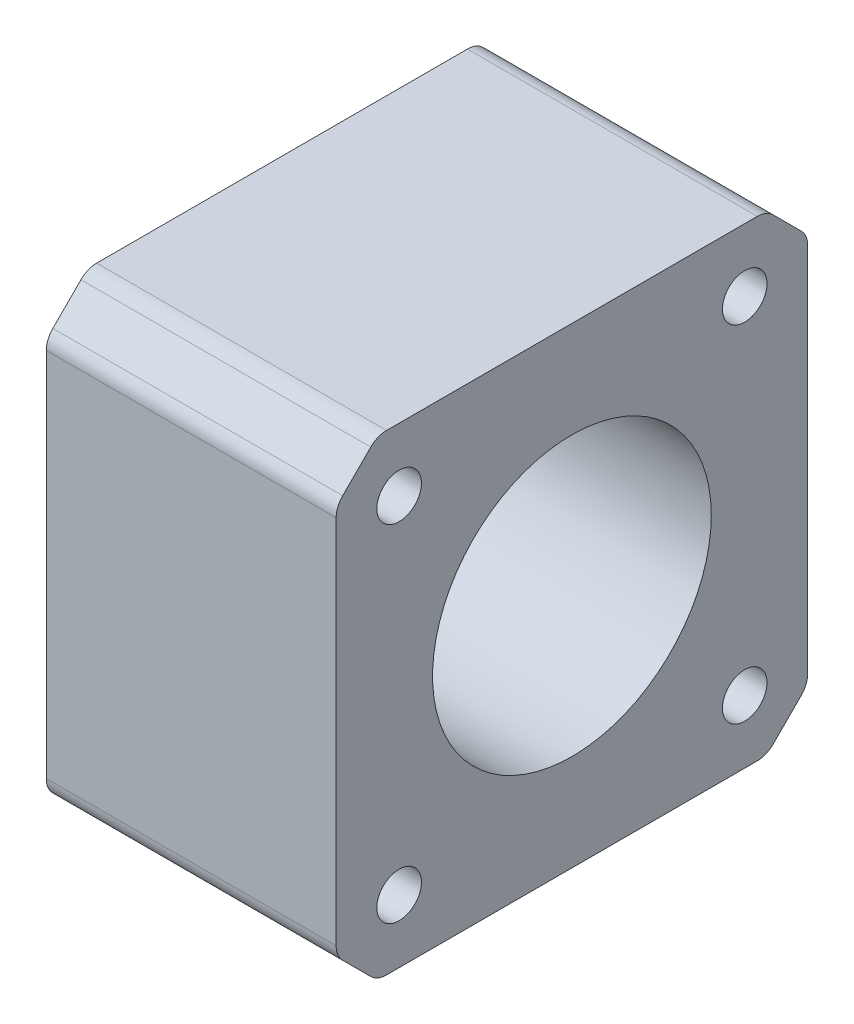
ISO-10303-21;
HEADER;
FILE_DESCRIPTION(('STEP AP214'),'2;1');
FILE_NAME('part.step','',(''),(''),'','','');
FILE_SCHEMA(('AUTOMOTIVE_DESIGN { 1 0 10303 214 1 1 1 1 }'));
ENDSEC;
DATA;
#1=APPLICATION_CONTEXT('core data for automotive mechanical design processes');
#2=APPLICATION_PROTOCOL_DEFINITION('international standard','automotive_design',2000,#1);
#3=PRODUCT_CONTEXT('',#1,'mechanical');
#4=PRODUCT('Part','Part','',(#3));
#5=PRODUCT_RELATED_PRODUCT_CATEGORY('part','',(#4));
#6=PRODUCT_DEFINITION_FORMATION('','',#4);
#7=PRODUCT_DEFINITION_CONTEXT('part definition',#1,'design');
#8=PRODUCT_DEFINITION('design','',#6,#7);
#9=PRODUCT_DEFINITION_SHAPE('','',#8);
#10=(LENGTH_UNIT() NAMED_UNIT(*) SI_UNIT(.MILLI.,.METRE.));
#11=(NAMED_UNIT(*) PLANE_ANGLE_UNIT() SI_UNIT($,.RADIAN.));
#12=(NAMED_UNIT(*) SI_UNIT($,.STERADIAN.) SOLID_ANGLE_UNIT());
#13=UNCERTAINTY_MEASURE_WITH_UNIT(LENGTH_MEASURE(1.E-05),#10,'distance_accuracy_value','');
#14=(GEOMETRIC_REPRESENTATION_CONTEXT(3) GLOBAL_UNCERTAINTY_ASSIGNED_CONTEXT((#13)) GLOBAL_UNIT_ASSIGNED_CONTEXT((#10,
#11,#12)) REPRESENTATION_CONTEXT('',''));
#15=CARTESIAN_POINT('',(0.,0.,0.));
#16=DIRECTION('',(0.,0.,1.));
#17=DIRECTION('',(1.,0.,0.));
#18=AXIS2_PLACEMENT_3D('',#15,#16,#17);
#19=CARTESIAN_POINT('',(26.,0.,0.));
#20=DIRECTION('',(1.,0.,0.));
#21=DIRECTION('',(0.,0.,-1.));
#22=AXIS2_PLACEMENT_3D('',#19,#20,#21);
#23=PLANE('',#22);
#24=CARTESIAN_POINT('',(26.,-15.5,15.5));
#25=DIRECTION('',(-1.,0.,0.));
#26=DIRECTION('',(0.,0.,-1.));
#27=AXIS2_PLACEMENT_3D('',#24,#25,#26);
#28=CIRCLE('',#27,2.);
#29=CARTESIAN_POINT('',(26.,-15.5,13.5));
#30=VERTEX_POINT('',#29);
#31=EDGE_CURVE('E320',#30,#30,#28,.T.);
#32=ORIENTED_EDGE('',*,*,#31,.T.);
#33=EDGE_LOOP('',(#32));
#34=FACE_BOUND('',#33,.T.);
#35=CARTESIAN_POINT('',(26.,15.5,-15.5));
#36=DIRECTION('',(1.,0.,0.));
#37=DIRECTION('',(0.,0.,-1.));
#38=AXIS2_PLACEMENT_3D('',#35,#36,#37);
#39=CIRCLE('',#38,2.);
#40=CARTESIAN_POINT('',(26.,15.5,-17.5));
#41=VERTEX_POINT('',#40);
#42=EDGE_CURVE('E314',#41,#41,#39,.T.);
#43=ORIENTED_EDGE('',*,*,#42,.F.);
#44=EDGE_LOOP('',(#43));
#45=FACE_BOUND('',#44,.T.);
#46=CARTESIAN_POINT('',(26.,15.5,15.5));
#47=DIRECTION('',(1.,0.,0.));
#48=DIRECTION('',(0.,0.,-1.));
#49=AXIS2_PLACEMENT_3D('',#46,#47,#48);
#50=CIRCLE('',#49,2.);
#51=CARTESIAN_POINT('',(26.,15.5,13.5));
#52=VERTEX_POINT('',#51);
#53=EDGE_CURVE('E308',#52,#52,#50,.T.);
#54=ORIENTED_EDGE('',*,*,#53,.F.);
#55=EDGE_LOOP('',(#54));
#56=FACE_BOUND('',#55,.T.);
#57=CARTESIAN_POINT('',(26.,0.,0.));
#58=DIRECTION('',(1.,0.,0.));
#59=DIRECTION('',(0.,0.,-1.));
#60=AXIS2_PLACEMENT_3D('',#57,#58,#59);
#61=CIRCLE('',#60,12.5);
#62=CARTESIAN_POINT('',(26.,0.,-12.5));
#63=VERTEX_POINT('',#62);
#64=EDGE_CURVE('E302',#63,#63,#61,.T.);
#65=ORIENTED_EDGE('',*,*,#64,.F.);
#66=EDGE_LOOP('',(#65));
#67=FACE_BOUND('',#66,.T.);
#68=DIRECTION('',(0.,0.707106781186549,-0.707106781186546));
#69=VECTOR('',#68,1.);
#70=CARTESIAN_POINT('',(26.,-21.15,-17.4580302527855));
#71=LINE('',#70,#69);
#72=CARTESIAN_POINT('',(26.,-20.5642135623731,-18.0438166904124));
#73=VERTEX_POINT('',#72);
#74=CARTESIAN_POINT('',(26.,-18.0438166904124,-20.5642135623731));
#75=VERTEX_POINT('',#74);
#76=EDGE_CURVE('E290',#73,#75,#71,.T.);
#77=ORIENTED_EDGE('',*,*,#76,.T.);
#78=CARTESIAN_POINT('',(26.,-16.6296031280393,-19.15));
#79=DIRECTION('',(1.,0.,0.));
#80=DIRECTION('',(0.,0.,-1.));
#81=AXIS2_PLACEMENT_3D('',#78,#79,#80);
#82=CIRCLE('',#81,2.);
#83=CARTESIAN_POINT('',(26.,-16.6296031280393,-21.15));
#84=VERTEX_POINT('',#83);
#85=EDGE_CURVE('E219',#75,#84,#82,.T.);
#86=ORIENTED_EDGE('',*,*,#85,.T.);
#87=DIRECTION('',(0.,1.,0.));
#88=VECTOR('',#87,1.);
#89=CARTESIAN_POINT('',(26.,17.4580302527855,-21.15));
#90=LINE('',#89,#88);
#91=CARTESIAN_POINT('',(26.,16.6296031280393,-21.15));
#92=VERTEX_POINT('',#91);
#93=EDGE_CURVE('E167',#84,#92,#90,.T.);
#94=ORIENTED_EDGE('',*,*,#93,.T.);
#95=CARTESIAN_POINT('',(26.,16.6296031280393,-19.15));
#96=DIRECTION('',(1.,0.,0.));
#97=DIRECTION('',(0.,0.,-1.));
#98=AXIS2_PLACEMENT_3D('',#95,#96,#97);
#99=CIRCLE('',#98,2.);
#100=CARTESIAN_POINT('',(26.,18.0438166904124,-20.5642135623731));
#101=VERTEX_POINT('',#100);
#102=EDGE_CURVE('E206',#92,#101,#99,.T.);
#103=ORIENTED_EDGE('',*,*,#102,.T.);
#104=DIRECTION('',(0.,0.707106781186543,0.707106781186552));
#105=VECTOR('',#104,1.);
#106=CARTESIAN_POINT('',(26.,21.15,-17.4580302527855));
#107=LINE('',#106,#105);
#108=CARTESIAN_POINT('',(26.,20.5642135623731,-18.0438166904124));
#109=VERTEX_POINT('',#108);
#110=EDGE_CURVE('E251',#101,#109,#107,.T.);
#111=ORIENTED_EDGE('',*,*,#110,.T.);
#112=CARTESIAN_POINT('',(26.,19.15,-16.6296031280393));
#113=DIRECTION('',(1.,0.,0.));
#114=DIRECTION('',(0.,0.,-1.));
#115=AXIS2_PLACEMENT_3D('',#112,#113,#114);
#116=CIRCLE('',#115,2.);
#117=CARTESIAN_POINT('',(26.,21.15,-16.6296031280393));
#118=VERTEX_POINT('',#117);
#119=EDGE_CURVE('E208',#109,#118,#116,.T.);
#120=ORIENTED_EDGE('',*,*,#119,.T.);
#121=DIRECTION('',(0.,0.,1.));
#122=VECTOR('',#121,1.);
#123=CARTESIAN_POINT('',(26.,21.15,17.4580302527855));
#124=LINE('',#123,#122);
#125=CARTESIAN_POINT('',(26.,21.15,16.6296031280393));
#126=VERTEX_POINT('',#125);
#127=EDGE_CURVE('E263',#118,#126,#124,.T.);
#128=ORIENTED_EDGE('',*,*,#127,.T.);
#129=CARTESIAN_POINT('',(26.,19.15,16.6296031280393));
#130=DIRECTION('',(1.,0.,0.));
#131=DIRECTION('',(0.,0.,-1.));
#132=AXIS2_PLACEMENT_3D('',#129,#130,#131);
#133=CIRCLE('',#132,2.);
#134=CARTESIAN_POINT('',(26.,20.5642135623731,18.0438166904124));
#135=VERTEX_POINT('',#134);
#136=EDGE_CURVE('E55',#126,#135,#133,.T.);
#137=ORIENTED_EDGE('',*,*,#136,.T.);
#138=DIRECTION('',(0.,-0.707106781186549,0.707106781186546));
#139=VECTOR('',#138,1.);
#140=CARTESIAN_POINT('',(26.,17.4580302527855,21.15));
#141=LINE('',#140,#139);
#142=CARTESIAN_POINT('',(26.,18.0438166904124,20.5642135623731));
#143=VERTEX_POINT('',#142);
#144=EDGE_CURVE('E189',#135,#143,#141,.T.);
#145=ORIENTED_EDGE('',*,*,#144,.T.);
#146=CARTESIAN_POINT('',(26.,16.6296031280393,19.15));
#147=DIRECTION('',(1.,0.,0.));
#148=DIRECTION('',(0.,0.,-1.));
#149=AXIS2_PLACEMENT_3D('',#146,#147,#148);
#150=CIRCLE('',#149,2.);
#151=CARTESIAN_POINT('',(26.,16.6296031280393,21.15));
#152=VERTEX_POINT('',#151);
#153=EDGE_CURVE('E211',#143,#152,#150,.T.);
#154=ORIENTED_EDGE('',*,*,#153,.T.);
#155=DIRECTION('',(0.,-1.,0.));
#156=VECTOR('',#155,1.);
#157=CARTESIAN_POINT('',(26.,17.4580302527855,21.15));
#158=LINE('',#157,#156);
#159=CARTESIAN_POINT('',(26.,-16.6296031280393,21.15));
#160=VERTEX_POINT('',#159);
#161=EDGE_CURVE('E188',#152,#160,#158,.T.);
#162=ORIENTED_EDGE('',*,*,#161,.T.);
#163=CARTESIAN_POINT('',(26.,-16.6296031280393,19.15));
#164=DIRECTION('',(1.,0.,0.));
#165=DIRECTION('',(0.,0.,-1.));
#166=AXIS2_PLACEMENT_3D('',#163,#164,#165);
#167=CIRCLE('',#166,2.);
#168=CARTESIAN_POINT('',(26.,-18.0438166904124,20.5642135623731));
#169=VERTEX_POINT('',#168);
#170=EDGE_CURVE('E213',#160,#169,#167,.T.);
#171=ORIENTED_EDGE('',*,*,#170,.T.);
#172=DIRECTION('',(0.,-0.707106781186544,-0.707106781186552));
#173=VECTOR('',#172,1.);
#174=CARTESIAN_POINT('',(26.,-21.15,17.4580302527855));
#175=LINE('',#174,#173);
#176=CARTESIAN_POINT('',(26.,-20.5642135623731,18.0438166904124));
#177=VERTEX_POINT('',#176);
#178=EDGE_CURVE('E295',#169,#177,#175,.T.);
#179=ORIENTED_EDGE('',*,*,#178,.T.);
#180=CARTESIAN_POINT('',(26.,-19.15,16.6296031280393));
#181=DIRECTION('',(1.,0.,0.));
#182=DIRECTION('',(0.,0.,-1.));
#183=AXIS2_PLACEMENT_3D('',#180,#181,#182);
#184=CIRCLE('',#183,2.);
#185=CARTESIAN_POINT('',(26.,-21.15,16.6296031280393));
#186=VERTEX_POINT('',#185);
#187=EDGE_CURVE('E215',#177,#186,#184,.T.);
#188=ORIENTED_EDGE('',*,*,#187,.T.);
#189=DIRECTION('',(0.,0.,-1.));
#190=VECTOR('',#189,1.);
#191=CARTESIAN_POINT('',(26.,-21.15,17.4580302527855));
#192=LINE('',#191,#190);
#193=CARTESIAN_POINT('',(26.,-21.15,-16.6296031280393));
#194=VERTEX_POINT('',#193);
#195=EDGE_CURVE('E291',#186,#194,#192,.T.);
#196=ORIENTED_EDGE('',*,*,#195,.T.);
#197=CARTESIAN_POINT('',(26.,-19.15,-16.6296031280393));
#198=DIRECTION('',(1.,0.,0.));
#199=DIRECTION('',(0.,0.,-1.));
#200=AXIS2_PLACEMENT_3D('',#197,#198,#199);
#201=CIRCLE('',#200,2.);
#202=EDGE_CURVE('E217',#194,#73,#201,.T.);
#203=ORIENTED_EDGE('',*,*,#202,.T.);
#204=EDGE_LOOP('',(#77,#86,#94,#103,#111,#120,#128,#137,#145,#154,#162,#171,#179,#188,#196,#203));
#205=FACE_BOUND('',#204,.T.);
#206=CARTESIAN_POINT('',(26.,-15.5,-15.5));
#207=DIRECTION('',(-1.,0.,0.));
#208=DIRECTION('',(0.,0.,-1.));
#209=AXIS2_PLACEMENT_3D('',#206,#207,#208);
#210=CIRCLE('',#209,2.);
#211=CARTESIAN_POINT('',(26.,-15.5,-17.5));
#212=VERTEX_POINT('',#211);
#213=EDGE_CURVE('E326',#212,#212,#210,.T.);
#214=ORIENTED_EDGE('',*,*,#213,.T.);
#215=EDGE_LOOP('',(#214));
#216=FACE_BOUND('',#215,.T.);
#217=ADVANCED_FACE('F33',(#34,#45,#56,#67,#205,#216),#23,.T.);
#218=CARTESIAN_POINT('',(0.,0.,0.));
#219=DIRECTION('',(1.,0.,0.));
#220=DIRECTION('',(0.,0.,-1.));
#221=AXIS2_PLACEMENT_3D('',#218,#219,#220);
#222=PLANE('',#221);
#223=CARTESIAN_POINT('',(0.,-15.5,15.5));
#224=DIRECTION('',(-1.,0.,0.));
#225=DIRECTION('',(0.,0.,-1.));
#226=AXIS2_PLACEMENT_3D('',#223,#224,#225);
#227=CIRCLE('',#226,2.);
#228=CARTESIAN_POINT('',(0.,-15.5,13.5));
#229=VERTEX_POINT('',#228);
#230=EDGE_CURVE('E317',#229,#229,#227,.T.);
#231=ORIENTED_EDGE('',*,*,#230,.F.);
#232=EDGE_LOOP('',(#231));
#233=FACE_BOUND('',#232,.T.);
#234=CARTESIAN_POINT('',(0.,15.5,-15.5));
#235=DIRECTION('',(1.,0.,0.));
#236=DIRECTION('',(0.,0.,-1.));
#237=AXIS2_PLACEMENT_3D('',#234,#235,#236);
#238=CIRCLE('',#237,2.);
#239=CARTESIAN_POINT('',(0.,15.5,-17.5));
#240=VERTEX_POINT('',#239);
#241=EDGE_CURVE('E311',#240,#240,#238,.T.);
#242=ORIENTED_EDGE('',*,*,#241,.T.);
#243=EDGE_LOOP('',(#242));
#244=FACE_BOUND('',#243,.T.);
#245=CARTESIAN_POINT('',(0.,15.5,15.5));
#246=DIRECTION('',(1.,0.,0.));
#247=DIRECTION('',(0.,0.,-1.));
#248=AXIS2_PLACEMENT_3D('',#245,#246,#247);
#249=CIRCLE('',#248,2.);
#250=CARTESIAN_POINT('',(0.,15.5,13.5));
#251=VERTEX_POINT('',#250);
#252=EDGE_CURVE('E305',#251,#251,#249,.T.);
#253=ORIENTED_EDGE('',*,*,#252,.T.);
#254=EDGE_LOOP('',(#253));
#255=FACE_BOUND('',#254,.T.);
#256=CARTESIAN_POINT('',(0.,0.,0.));
#257=DIRECTION('',(1.,0.,0.));
#258=DIRECTION('',(0.,0.,-1.));
#259=AXIS2_PLACEMENT_3D('',#256,#257,#258);
#260=CIRCLE('',#259,12.5);
#261=CARTESIAN_POINT('',(0.,0.,-12.5));
#262=VERTEX_POINT('',#261);
#263=EDGE_CURVE('E273',#262,#262,#260,.T.);
#264=ORIENTED_EDGE('',*,*,#263,.T.);
#265=EDGE_LOOP('',(#264));
#266=FACE_BOUND('',#265,.T.);
#267=DIRECTION('',(0.,1.,0.));
#268=VECTOR('',#267,1.);
#269=CARTESIAN_POINT('',(0.,17.4580302527855,-21.15));
#270=LINE('',#269,#268);
#271=CARTESIAN_POINT('',(0.,-16.6296031280393,-21.15));
#272=VERTEX_POINT('',#271);
#273=CARTESIAN_POINT('',(0.,16.6296031280393,-21.15));
#274=VERTEX_POINT('',#273);
#275=EDGE_CURVE('E164',#272,#274,#270,.T.);
#276=ORIENTED_EDGE('',*,*,#275,.F.);
#277=CARTESIAN_POINT('',(0.,-16.6296031280393,-19.15));
#278=DIRECTION('',(1.,0.,0.));
#279=DIRECTION('',(0.,0.,-1.));
#280=AXIS2_PLACEMENT_3D('',#277,#278,#279);
#281=CIRCLE('',#280,2.);
#282=CARTESIAN_POINT('',(0.,-18.0438166904124,-20.5642135623731));
#283=VERTEX_POINT('',#282);
#284=EDGE_CURVE('E147',#272,#283,#281,.F.);
#285=ORIENTED_EDGE('',*,*,#284,.T.);
#286=DIRECTION('',(0.,0.707106781186549,-0.707106781186546));
#287=VECTOR('',#286,1.);
#288=CARTESIAN_POINT('',(0.,-21.15,-17.4580302527855));
#289=LINE('',#288,#287);
#290=CARTESIAN_POINT('',(0.,-20.5642135623731,-18.0438166904124));
#291=VERTEX_POINT('',#290);
#292=EDGE_CURVE('E175',#291,#283,#289,.T.);
#293=ORIENTED_EDGE('',*,*,#292,.F.);
#294=CARTESIAN_POINT('',(0.,-19.15,-16.6296031280393));
#295=DIRECTION('',(1.,0.,0.));
#296=DIRECTION('',(0.,0.,-1.));
#297=AXIS2_PLACEMENT_3D('',#294,#295,#296);
#298=CIRCLE('',#297,2.);
#299=CARTESIAN_POINT('',(0.,-21.15,-16.6296031280393));
#300=VERTEX_POINT('',#299);
#301=EDGE_CURVE('E158',#291,#300,#298,.F.);
#302=ORIENTED_EDGE('',*,*,#301,.T.);
#303=DIRECTION('',(0.,0.,-1.));
#304=VECTOR('',#303,1.);
#305=CARTESIAN_POINT('',(0.,-21.15,17.4580302527855));
#306=LINE('',#305,#304);
#307=CARTESIAN_POINT('',(0.,-21.15,16.6296031280393));
#308=VERTEX_POINT('',#307);
#309=EDGE_CURVE('E180',#308,#300,#306,.T.);
#310=ORIENTED_EDGE('',*,*,#309,.F.);
#311=CARTESIAN_POINT('',(0.,-19.15,16.6296031280393));
#312=DIRECTION('',(1.,0.,0.));
#313=DIRECTION('',(0.,0.,-1.));
#314=AXIS2_PLACEMENT_3D('',#311,#312,#313);
#315=CIRCLE('',#314,2.);
#316=CARTESIAN_POINT('',(0.,-20.5642135623731,18.0438166904124));
#317=VERTEX_POINT('',#316);
#318=EDGE_CURVE('E200',#308,#317,#315,.F.);
#319=ORIENTED_EDGE('',*,*,#318,.T.);
#320=DIRECTION('',(0.,-0.707106781186544,-0.707106781186552));
#321=VECTOR('',#320,1.);
#322=CARTESIAN_POINT('',(0.,-21.15,17.4580302527855));
#323=LINE('',#322,#321);
#324=CARTESIAN_POINT('',(0.,-18.0438166904124,20.5642135623731));
#325=VERTEX_POINT('',#324);
#326=EDGE_CURVE('E272',#325,#317,#323,.T.);
#327=ORIENTED_EDGE('',*,*,#326,.F.);
#328=CARTESIAN_POINT('',(0.,-16.6296031280393,19.15));
#329=DIRECTION('',(1.,0.,0.));
#330=DIRECTION('',(0.,0.,-1.));
#331=AXIS2_PLACEMENT_3D('',#328,#329,#330);
#332=CIRCLE('',#331,2.);
#333=CARTESIAN_POINT('',(0.,-16.6296031280393,21.15));
#334=VERTEX_POINT('',#333);
#335=EDGE_CURVE('E198',#325,#334,#332,.F.);
#336=ORIENTED_EDGE('',*,*,#335,.T.);
#337=DIRECTION('',(0.,-1.,0.));
#338=VECTOR('',#337,1.);
#339=CARTESIAN_POINT('',(0.,17.4580302527855,21.15));
#340=LINE('',#339,#338);
#341=CARTESIAN_POINT('',(0.,16.6296031280393,21.15));
#342=VERTEX_POINT('',#341);
#343=EDGE_CURVE('E269',#342,#334,#340,.T.);
#344=ORIENTED_EDGE('',*,*,#343,.F.);
#345=CARTESIAN_POINT('',(0.,16.6296031280393,19.15));
#346=DIRECTION('',(1.,0.,0.));
#347=DIRECTION('',(0.,0.,-1.));
#348=AXIS2_PLACEMENT_3D('',#345,#346,#347);
#349=CIRCLE('',#348,2.);
#350=CARTESIAN_POINT('',(0.,18.0438166904124,20.5642135623731));
#351=VERTEX_POINT('',#350);
#352=EDGE_CURVE('E196',#342,#351,#349,.F.);
#353=ORIENTED_EDGE('',*,*,#352,.T.);
#354=DIRECTION('',(0.,-0.707106781186549,0.707106781186546));
#355=VECTOR('',#354,1.);
#356=CARTESIAN_POINT('',(0.,17.4580302527855,21.15));
#357=LINE('',#356,#355);
#358=CARTESIAN_POINT('',(0.,20.5642135623731,18.0438166904124));
#359=VERTEX_POINT('',#358);
#360=EDGE_CURVE('E186',#359,#351,#357,.T.);
#361=ORIENTED_EDGE('',*,*,#360,.F.);
#362=CARTESIAN_POINT('',(0.,19.15,16.6296031280393));
#363=DIRECTION('',(1.,0.,0.));
#364=DIRECTION('',(0.,0.,-1.));
#365=AXIS2_PLACEMENT_3D('',#362,#363,#364);
#366=CIRCLE('',#365,2.);
#367=CARTESIAN_POINT('',(0.,21.15,16.6296031280393));
#368=VERTEX_POINT('',#367);
#369=EDGE_CURVE('E194',#359,#368,#366,.F.);
#370=ORIENTED_EDGE('',*,*,#369,.T.);
#371=DIRECTION('',(0.,0.,1.));
#372=VECTOR('',#371,1.);
#373=CARTESIAN_POINT('',(0.,21.15,17.4580302527855));
#374=LINE('',#373,#372);
#375=CARTESIAN_POINT('',(0.,21.15,-16.6296031280393));
#376=VERTEX_POINT('',#375);
#377=EDGE_CURVE('E178',#376,#368,#374,.T.);
#378=ORIENTED_EDGE('',*,*,#377,.F.);
#379=CARTESIAN_POINT('',(0.,19.15,-16.6296031280393));
#380=DIRECTION('',(1.,0.,0.));
#381=DIRECTION('',(0.,0.,-1.));
#382=AXIS2_PLACEMENT_3D('',#379,#380,#381);
#383=CIRCLE('',#382,2.);
#384=CARTESIAN_POINT('',(0.,20.5642135623731,-18.0438166904124));
#385=VERTEX_POINT('',#384);
#386=EDGE_CURVE('E192',#376,#385,#383,.F.);
#387=ORIENTED_EDGE('',*,*,#386,.T.);
#388=DIRECTION('',(0.,0.707106781186543,0.707106781186552));
#389=VECTOR('',#388,1.);
#390=CARTESIAN_POINT('',(0.,21.15,-17.4580302527855));
#391=LINE('',#390,#389);
#392=CARTESIAN_POINT('',(0.,18.0438166904124,-20.5642135623731));
#393=VERTEX_POINT('',#392);
#394=EDGE_CURVE('E174',#393,#385,#391,.T.);
#395=ORIENTED_EDGE('',*,*,#394,.F.);
#396=CARTESIAN_POINT('',(0.,16.6296031280393,-19.15));
#397=DIRECTION('',(1.,0.,0.));
#398=DIRECTION('',(0.,0.,-1.));
#399=AXIS2_PLACEMENT_3D('',#396,#397,#398);
#400=CIRCLE('',#399,2.);
#401=EDGE_CURVE('E168',#393,#274,#400,.F.);
#402=ORIENTED_EDGE('',*,*,#401,.T.);
#403=EDGE_LOOP('',(#276,#285,#293,#302,#310,#319,#327,#336,#344,#353,#361,#370,#378,#387,#395,#402));
#404=FACE_BOUND('',#403,.T.);
#405=CARTESIAN_POINT('',(0.,-15.5,-15.5));
#406=DIRECTION('',(-1.,0.,0.));
#407=DIRECTION('',(0.,0.,-1.));
#408=AXIS2_PLACEMENT_3D('',#405,#406,#407);
#409=CIRCLE('',#408,2.);
#410=CARTESIAN_POINT('',(0.,-15.5,-17.5));
#411=VERTEX_POINT('',#410);
#412=EDGE_CURVE('E323',#411,#411,#409,.T.);
#413=ORIENTED_EDGE('',*,*,#412,.F.);
#414=EDGE_LOOP('',(#413));
#415=FACE_BOUND('',#414,.T.);
#416=ADVANCED_FACE('F171',(#233,#244,#255,#266,#404,#415),#222,.F.);
#417=CARTESIAN_POINT('',(26.,17.4580302527855,21.15));
#418=DIRECTION('',(0.,0.,-1.));
#419=DIRECTION('',(0.,1.,0.));
#420=AXIS2_PLACEMENT_3D('',#417,#418,#419);
#421=PLANE('',#420);
#422=ORIENTED_EDGE('',*,*,#343,.T.);
#423=DIRECTION('',(-1.,0.,0.));
#424=VECTOR('',#423,1.);
#425=CARTESIAN_POINT('',(26.,-16.6296031280393,21.15));
#426=LINE('',#425,#424);
#427=EDGE_CURVE('E234',#334,#160,#426,.F.);
#428=ORIENTED_EDGE('',*,*,#427,.T.);
#429=ORIENTED_EDGE('',*,*,#161,.F.);
#430=DIRECTION('',(-1.,0.,0.));
#431=VECTOR('',#430,1.);
#432=CARTESIAN_POINT('',(26.,16.6296031280393,21.15));
#433=LINE('',#432,#431);
#434=EDGE_CURVE('E231',#152,#342,#433,.T.);
#435=ORIENTED_EDGE('',*,*,#434,.T.);
#436=EDGE_LOOP('',(#422,#428,#429,#435));
#437=FACE_BOUND('',#436,.T.);
#438=ADVANCED_FACE('F335',(#437),#421,.F.);
#439=CARTESIAN_POINT('',(26.,-21.15,17.4580302527855));
#440=DIRECTION('',(0.,0.707106781186552,-0.707106781186544));
#441=DIRECTION('',(0.,0.707106781186544,0.707106781186552));
#442=AXIS2_PLACEMENT_3D('',#439,#440,#441);
#443=PLANE('',#442);
#444=ORIENTED_EDGE('',*,*,#326,.T.);
#445=DIRECTION('',(-1.,0.,0.));
#446=VECTOR('',#445,1.);
#447=CARTESIAN_POINT('',(26.,-20.5642135623731,18.0438166904124));
#448=LINE('',#447,#446);
#449=EDGE_CURVE('E229',#317,#177,#448,.F.);
#450=ORIENTED_EDGE('',*,*,#449,.T.);
#451=ORIENTED_EDGE('',*,*,#178,.F.);
#452=DIRECTION('',(-1.,0.,0.));
#453=VECTOR('',#452,1.);
#454=CARTESIAN_POINT('',(26.,-18.0438166904124,20.5642135623731));
#455=LINE('',#454,#453);
#456=EDGE_CURVE('E226',#169,#325,#455,.T.);
#457=ORIENTED_EDGE('',*,*,#456,.T.);
#458=EDGE_LOOP('',(#444,#450,#451,#457));
#459=FACE_BOUND('',#458,.T.);
#460=ADVANCED_FACE('F342',(#459),#443,.F.);
#461=CARTESIAN_POINT('',(26.,-21.15,17.4580302527855));
#462=DIRECTION('',(0.,1.,0.));
#463=DIRECTION('',(0.,0.,1.));
#464=AXIS2_PLACEMENT_3D('',#461,#462,#463);
#465=PLANE('',#464);
#466=ORIENTED_EDGE('',*,*,#309,.T.);
#467=DIRECTION('',(-1.,0.,0.));
#468=VECTOR('',#467,1.);
#469=CARTESIAN_POINT('',(26.,-21.15,-16.6296031280393));
#470=LINE('',#469,#468);
#471=EDGE_CURVE('E224',#300,#194,#470,.F.);
#472=ORIENTED_EDGE('',*,*,#471,.T.);
#473=ORIENTED_EDGE('',*,*,#195,.F.);
#474=DIRECTION('',(-1.,0.,0.));
#475=VECTOR('',#474,1.);
#476=CARTESIAN_POINT('',(26.,-21.15,16.6296031280393));
#477=LINE('',#476,#475);
#478=EDGE_CURVE('E221',#186,#308,#477,.T.);
#479=ORIENTED_EDGE('',*,*,#478,.T.);
#480=EDGE_LOOP('',(#466,#472,#473,#479));
#481=FACE_BOUND('',#480,.T.);
#482=ADVANCED_FACE('F279',(#481),#465,.F.);
#483=CARTESIAN_POINT('',(26.,-21.15,-17.4580302527855));
#484=DIRECTION('',(0.,0.707106781186546,0.707106781186549));
#485=DIRECTION('',(0.,-0.707106781186549,0.707106781186546));
#486=AXIS2_PLACEMENT_3D('',#483,#484,#485);
#487=PLANE('',#486);
#488=ORIENTED_EDGE('',*,*,#292,.T.);
#489=DIRECTION('',(-1.,0.,0.));
#490=VECTOR('',#489,1.);
#491=CARTESIAN_POINT('',(26.,-18.0438166904124,-20.5642135623731));
#492=LINE('',#491,#490);
#493=EDGE_CURVE('E152',#283,#75,#492,.F.);
#494=ORIENTED_EDGE('',*,*,#493,.T.);
#495=ORIENTED_EDGE('',*,*,#76,.F.);
#496=DIRECTION('',(-1.,0.,0.));
#497=VECTOR('',#496,1.);
#498=CARTESIAN_POINT('',(26.,-20.5642135623731,-18.0438166904124));
#499=LINE('',#498,#497);
#500=EDGE_CURVE('E157',#73,#291,#499,.T.);
#501=ORIENTED_EDGE('',*,*,#500,.T.);
#502=EDGE_LOOP('',(#488,#494,#495,#501));
#503=FACE_BOUND('',#502,.T.);
#504=ADVANCED_FACE('F293',(#503),#487,.F.);
#505=CARTESIAN_POINT('',(26.,17.4580302527855,-21.15));
#506=DIRECTION('',(0.,0.,1.));
#507=DIRECTION('',(0.,-1.,0.));
#508=AXIS2_PLACEMENT_3D('',#505,#506,#507);
#509=PLANE('',#508);
#510=ORIENTED_EDGE('',*,*,#93,.F.);
#511=DIRECTION('',(-1.,0.,0.));
#512=VECTOR('',#511,1.);
#513=CARTESIAN_POINT('',(26.,-16.6296031280393,-21.15));
#514=LINE('',#513,#512);
#515=EDGE_CURVE('E151',#84,#272,#514,.T.);
#516=ORIENTED_EDGE('',*,*,#515,.T.);
#517=ORIENTED_EDGE('',*,*,#275,.T.);
#518=DIRECTION('',(-1.,0.,0.));
#519=VECTOR('',#518,1.);
#520=CARTESIAN_POINT('',(26.,16.6296031280393,-21.15));
#521=LINE('',#520,#519);
#522=EDGE_CURVE('E169',#274,#92,#521,.F.);
#523=ORIENTED_EDGE('',*,*,#522,.T.);
#524=EDGE_LOOP('',(#510,#516,#517,#523));
#525=FACE_BOUND('',#524,.T.);
#526=ADVANCED_FACE('F163',(#525),#509,.F.);
#527=CARTESIAN_POINT('',(26.,21.15,-17.4580302527855));
#528=DIRECTION('',(0.,-0.707106781186552,0.707106781186543));
#529=DIRECTION('',(0.,-0.707106781186543,-0.707106781186552));
#530=AXIS2_PLACEMENT_3D('',#527,#528,#529);
#531=PLANE('',#530);
#532=ORIENTED_EDGE('',*,*,#394,.T.);
#533=DIRECTION('',(-1.,0.,0.));
#534=VECTOR('',#533,1.);
#535=CARTESIAN_POINT('',(26.,20.5642135623731,-18.0438166904124));
#536=LINE('',#535,#534);
#537=EDGE_CURVE('E11',#385,#109,#536,.F.);
#538=ORIENTED_EDGE('',*,*,#537,.T.);
#539=ORIENTED_EDGE('',*,*,#110,.F.);
#540=DIRECTION('',(-1.,0.,0.));
#541=VECTOR('',#540,1.);
#542=CARTESIAN_POINT('',(26.,18.0438166904124,-20.5642135623731));
#543=LINE('',#542,#541);
#544=EDGE_CURVE('E41',#101,#393,#543,.T.);
#545=ORIENTED_EDGE('',*,*,#544,.T.);
#546=EDGE_LOOP('',(#532,#538,#539,#545));
#547=FACE_BOUND('',#546,.T.);
#548=ADVANCED_FACE('F248',(#547),#531,.F.);
#549=CARTESIAN_POINT('',(26.,21.15,17.4580302527855));
#550=DIRECTION('',(0.,-1.,0.));
#551=DIRECTION('',(0.,0.,-1.));
#552=AXIS2_PLACEMENT_3D('',#549,#550,#551);
#553=PLANE('',#552);
#554=ORIENTED_EDGE('',*,*,#377,.T.);
#555=DIRECTION('',(-1.,0.,0.));
#556=VECTOR('',#555,1.);
#557=CARTESIAN_POINT('',(26.,21.15,16.6296031280393));
#558=LINE('',#557,#556);
#559=EDGE_CURVE('E243',#368,#126,#558,.F.);
#560=ORIENTED_EDGE('',*,*,#559,.T.);
#561=ORIENTED_EDGE('',*,*,#127,.F.);
#562=DIRECTION('',(-1.,0.,0.));
#563=VECTOR('',#562,1.);
#564=CARTESIAN_POINT('',(26.,21.15,-16.6296031280393));
#565=LINE('',#564,#563);
#566=EDGE_CURVE('E240',#118,#376,#565,.T.);
#567=ORIENTED_EDGE('',*,*,#566,.T.);
#568=EDGE_LOOP('',(#554,#560,#561,#567));
#569=FACE_BOUND('',#568,.T.);
#570=ADVANCED_FACE('F261',(#569),#553,.F.);
#571=CARTESIAN_POINT('',(26.,17.4580302527855,21.15));
#572=DIRECTION('',(0.,-0.707106781186546,-0.707106781186549));
#573=DIRECTION('',(0.,0.707106781186549,-0.707106781186546));
#574=AXIS2_PLACEMENT_3D('',#571,#572,#573);
#575=PLANE('',#574);
#576=ORIENTED_EDGE('',*,*,#360,.T.);
#577=DIRECTION('',(-1.,0.,0.));
#578=VECTOR('',#577,1.);
#579=CARTESIAN_POINT('',(26.,18.0438166904124,20.5642135623731));
#580=LINE('',#579,#578);
#581=EDGE_CURVE('E48',#351,#143,#580,.F.);
#582=ORIENTED_EDGE('',*,*,#581,.T.);
#583=ORIENTED_EDGE('',*,*,#144,.F.);
#584=DIRECTION('',(-1.,0.,0.));
#585=VECTOR('',#584,1.);
#586=CARTESIAN_POINT('',(26.,20.5642135623731,18.0438166904124));
#587=LINE('',#586,#585);
#588=EDGE_CURVE('E236',#135,#359,#587,.T.);
#589=ORIENTED_EDGE('',*,*,#588,.T.);
#590=EDGE_LOOP('',(#576,#582,#583,#589));
#591=FACE_BOUND('',#590,.T.);
#592=ADVANCED_FACE('F351',(#591),#575,.F.);
#593=CARTESIAN_POINT('',(26.,-16.6296031280393,-19.15));
#594=DIRECTION('',(-1.,0.,0.));
#595=DIRECTION('',(0.,0.,1.));
#596=AXIS2_PLACEMENT_3D('',#593,#594,#595);
#597=CYLINDRICAL_SURFACE('',#596,2.);
#598=ORIENTED_EDGE('',*,*,#85,.F.);
#599=ORIENTED_EDGE('',*,*,#493,.F.);
#600=ORIENTED_EDGE('',*,*,#284,.F.);
#601=ORIENTED_EDGE('',*,*,#515,.F.);
#602=EDGE_LOOP('',(#598,#599,#600,#601));
#603=FACE_BOUND('',#602,.T.);
#604=ADVANCED_FACE('F150',(#603),#597,.T.);
#605=CARTESIAN_POINT('',(26.,-19.15,-16.6296031280393));
#606=DIRECTION('',(-1.,0.,0.));
#607=DIRECTION('',(0.,0.,1.));
#608=AXIS2_PLACEMENT_3D('',#605,#606,#607);
#609=CYLINDRICAL_SURFACE('',#608,2.);
#610=ORIENTED_EDGE('',*,*,#202,.F.);
#611=ORIENTED_EDGE('',*,*,#471,.F.);
#612=ORIENTED_EDGE('',*,*,#301,.F.);
#613=ORIENTED_EDGE('',*,*,#500,.F.);
#614=EDGE_LOOP('',(#610,#611,#612,#613));
#615=FACE_BOUND('',#614,.T.);
#616=ADVANCED_FACE('F285',(#615),#609,.T.);
#617=CARTESIAN_POINT('',(26.,-19.15,16.6296031280393));
#618=DIRECTION('',(-1.,0.,0.));
#619=DIRECTION('',(0.,0.,1.));
#620=AXIS2_PLACEMENT_3D('',#617,#618,#619);
#621=CYLINDRICAL_SURFACE('',#620,2.);
#622=ORIENTED_EDGE('',*,*,#187,.F.);
#623=ORIENTED_EDGE('',*,*,#449,.F.);
#624=ORIENTED_EDGE('',*,*,#318,.F.);
#625=ORIENTED_EDGE('',*,*,#478,.F.);
#626=EDGE_LOOP('',(#622,#623,#624,#625));
#627=FACE_BOUND('',#626,.T.);
#628=ADVANCED_FACE('F371',(#627),#621,.T.);
#629=CARTESIAN_POINT('',(26.,-16.6296031280393,19.15));
#630=DIRECTION('',(-1.,0.,0.));
#631=DIRECTION('',(0.,0.,1.));
#632=AXIS2_PLACEMENT_3D('',#629,#630,#631);
#633=CYLINDRICAL_SURFACE('',#632,2.);
#634=ORIENTED_EDGE('',*,*,#170,.F.);
#635=ORIENTED_EDGE('',*,*,#427,.F.);
#636=ORIENTED_EDGE('',*,*,#335,.F.);
#637=ORIENTED_EDGE('',*,*,#456,.F.);
#638=EDGE_LOOP('',(#634,#635,#636,#637));
#639=FACE_BOUND('',#638,.T.);
#640=ADVANCED_FACE('F374',(#639),#633,.T.);
#641=CARTESIAN_POINT('',(26.,16.6296031280393,19.15));
#642=DIRECTION('',(-1.,0.,0.));
#643=DIRECTION('',(0.,0.,1.));
#644=AXIS2_PLACEMENT_3D('',#641,#642,#643);
#645=CYLINDRICAL_SURFACE('',#644,2.);
#646=ORIENTED_EDGE('',*,*,#153,.F.);
#647=ORIENTED_EDGE('',*,*,#581,.F.);
#648=ORIENTED_EDGE('',*,*,#352,.F.);
#649=ORIENTED_EDGE('',*,*,#434,.F.);
#650=EDGE_LOOP('',(#646,#647,#648,#649));
#651=FACE_BOUND('',#650,.T.);
#652=ADVANCED_FACE('F378',(#651),#645,.T.);
#653=CARTESIAN_POINT('',(26.,19.15,16.6296031280393));
#654=DIRECTION('',(-1.,0.,0.));
#655=DIRECTION('',(0.,0.,1.));
#656=AXIS2_PLACEMENT_3D('',#653,#654,#655);
#657=CYLINDRICAL_SURFACE('',#656,2.);
#658=ORIENTED_EDGE('',*,*,#136,.F.);
#659=ORIENTED_EDGE('',*,*,#559,.F.);
#660=ORIENTED_EDGE('',*,*,#369,.F.);
#661=ORIENTED_EDGE('',*,*,#588,.F.);
#662=EDGE_LOOP('',(#658,#659,#660,#661));
#663=FACE_BOUND('',#662,.T.);
#664=ADVANCED_FACE('F382',(#663),#657,.T.);
#665=CARTESIAN_POINT('',(26.,19.15,-16.6296031280393));
#666=DIRECTION('',(-1.,0.,0.));
#667=DIRECTION('',(0.,0.,1.));
#668=AXIS2_PLACEMENT_3D('',#665,#666,#667);
#669=CYLINDRICAL_SURFACE('',#668,2.);
#670=ORIENTED_EDGE('',*,*,#119,.F.);
#671=ORIENTED_EDGE('',*,*,#537,.F.);
#672=ORIENTED_EDGE('',*,*,#386,.F.);
#673=ORIENTED_EDGE('',*,*,#566,.F.);
#674=EDGE_LOOP('',(#670,#671,#672,#673));
#675=FACE_BOUND('',#674,.T.);
#676=ADVANCED_FACE('F258',(#675),#669,.T.);
#677=CARTESIAN_POINT('',(26.,16.6296031280393,-19.15));
#678=DIRECTION('',(-1.,0.,0.));
#679=DIRECTION('',(0.,0.,1.));
#680=AXIS2_PLACEMENT_3D('',#677,#678,#679);
#681=CYLINDRICAL_SURFACE('',#680,2.);
#682=ORIENTED_EDGE('',*,*,#102,.F.);
#683=ORIENTED_EDGE('',*,*,#522,.F.);
#684=ORIENTED_EDGE('',*,*,#401,.F.);
#685=ORIENTED_EDGE('',*,*,#544,.F.);
#686=EDGE_LOOP('',(#682,#683,#684,#685));
#687=FACE_BOUND('',#686,.T.);
#688=ADVANCED_FACE('F35',(#687),#681,.T.);
#689=CARTESIAN_POINT('',(0.,0.,0.));
#690=DIRECTION('',(1.,0.,0.));
#691=DIRECTION('',(0.,0.,-1.));
#692=AXIS2_PLACEMENT_3D('',#689,#690,#691);
#693=CYLINDRICAL_SURFACE('',#692,12.5);
#694=ORIENTED_EDGE('',*,*,#263,.F.);
#695=EDGE_LOOP('',(#694));
#696=FACE_BOUND('',#695,.T.);
#697=ORIENTED_EDGE('',*,*,#64,.T.);
#698=EDGE_LOOP('',(#697));
#699=FACE_BOUND('',#698,.T.);
#700=ADVANCED_FACE('F390',(#696,#699),#693,.F.);
#701=CARTESIAN_POINT('',(0.,15.5,15.5));
#702=DIRECTION('',(1.,0.,0.));
#703=DIRECTION('',(0.,0.,-1.));
#704=AXIS2_PLACEMENT_3D('',#701,#702,#703);
#705=CYLINDRICAL_SURFACE('',#704,2.);
#706=ORIENTED_EDGE('',*,*,#252,.F.);
#707=EDGE_LOOP('',(#706));
#708=FACE_BOUND('',#707,.T.);
#709=ORIENTED_EDGE('',*,*,#53,.T.);
#710=EDGE_LOOP('',(#709));
#711=FACE_BOUND('',#710,.T.);
#712=ADVANCED_FACE('F394',(#708,#711),#705,.F.);
#713=CARTESIAN_POINT('',(0.,15.5,-15.5));
#714=DIRECTION('',(1.,0.,0.));
#715=DIRECTION('',(0.,0.,-1.));
#716=AXIS2_PLACEMENT_3D('',#713,#714,#715);
#717=CYLINDRICAL_SURFACE('',#716,2.);
#718=ORIENTED_EDGE('',*,*,#241,.F.);
#719=EDGE_LOOP('',(#718));
#720=FACE_BOUND('',#719,.T.);
#721=ORIENTED_EDGE('',*,*,#42,.T.);
#722=EDGE_LOOP('',(#721));
#723=FACE_BOUND('',#722,.T.);
#724=ADVANCED_FACE('F399',(#720,#723),#717,.F.);
#725=CARTESIAN_POINT('',(0.,-15.5,15.5));
#726=DIRECTION('',(1.,0.,0.));
#727=DIRECTION('',(0.,0.,-1.));
#728=AXIS2_PLACEMENT_3D('',#725,#726,#727);
#729=CYLINDRICAL_SURFACE('',#728,2.);
#730=ORIENTED_EDGE('',*,*,#230,.T.);
#731=EDGE_LOOP('',(#730));
#732=FACE_BOUND('',#731,.T.);
#733=ORIENTED_EDGE('',*,*,#31,.F.);
#734=EDGE_LOOP('',(#733));
#735=FACE_BOUND('',#734,.T.);
#736=ADVANCED_FACE('F407',(#732,#735),#729,.F.);
#737=CARTESIAN_POINT('',(0.,-15.5,-15.5));
#738=DIRECTION('',(1.,0.,0.));
#739=DIRECTION('',(0.,0.,-1.));
#740=AXIS2_PLACEMENT_3D('',#737,#738,#739);
#741=CYLINDRICAL_SURFACE('',#740,2.);
#742=ORIENTED_EDGE('',*,*,#412,.T.);
#743=EDGE_LOOP('',(#742));
#744=FACE_BOUND('',#743,.T.);
#745=ORIENTED_EDGE('',*,*,#213,.F.);
#746=EDGE_LOOP('',(#745));
#747=FACE_BOUND('',#746,.T.);
#748=ADVANCED_FACE('F332',(#744,#747),#741,.F.);
#749=CLOSED_SHELL('',(#217,#416,#438,#460,#482,#504,#526,#548,#570,#592,#604,#616,#628,#640,
#652,#664,#676,#688,#700,#712,#724,#736,#748));
#750=MANIFOLD_SOLID_BREP('B2',#749);
#751=ADVANCED_BREP_SHAPE_REPRESENTATION('',(#18,#750),#14);
#752=SHAPE_DEFINITION_REPRESENTATION(#9,#751);
ENDSEC;
END-ISO-10303-21;
